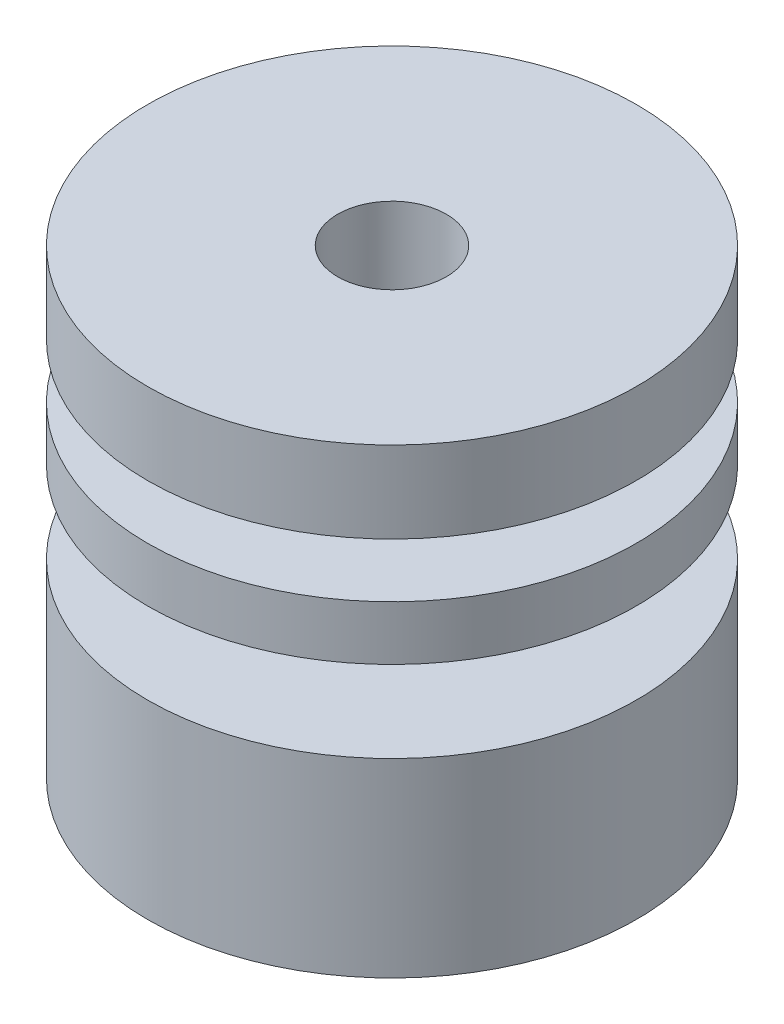
ISO-10303-21;
HEADER;
FILE_DESCRIPTION(('STEP AP214'),'2;1');
FILE_NAME('part.step','',(''),(''),'','','');
FILE_SCHEMA(('AUTOMOTIVE_DESIGN { 1 0 10303 214 1 1 1 1 }'));
ENDSEC;
DATA;
#1=APPLICATION_CONTEXT('core data for automotive mechanical design processes');
#2=APPLICATION_PROTOCOL_DEFINITION('international standard','automotive_design',2000,#1);
#3=PRODUCT_CONTEXT('',#1,'mechanical');
#4=PRODUCT('Part','Part','',(#3));
#5=PRODUCT_RELATED_PRODUCT_CATEGORY('part','',(#4));
#6=PRODUCT_DEFINITION_FORMATION('','',#4);
#7=PRODUCT_DEFINITION_CONTEXT('part definition',#1,'design');
#8=PRODUCT_DEFINITION('design','',#6,#7);
#9=PRODUCT_DEFINITION_SHAPE('','',#8);
#10=(LENGTH_UNIT() NAMED_UNIT(*) SI_UNIT(.MILLI.,.METRE.));
#11=(NAMED_UNIT(*) PLANE_ANGLE_UNIT() SI_UNIT($,.RADIAN.));
#12=(NAMED_UNIT(*) SI_UNIT($,.STERADIAN.) SOLID_ANGLE_UNIT());
#13=UNCERTAINTY_MEASURE_WITH_UNIT(LENGTH_MEASURE(1.E-05),#10,'distance_accuracy_value','');
#14=(GEOMETRIC_REPRESENTATION_CONTEXT(3) GLOBAL_UNCERTAINTY_ASSIGNED_CONTEXT((#13)) GLOBAL_UNIT_ASSIGNED_CONTEXT((#10,
#11,#12)) REPRESENTATION_CONTEXT('',''));
#15=CARTESIAN_POINT('',(0.,0.,0.));
#16=DIRECTION('',(0.,0.,1.));
#17=DIRECTION('',(1.,0.,0.));
#18=AXIS2_PLACEMENT_3D('',#15,#16,#17);
#19=CARTESIAN_POINT('',(0.,0.,0.));
#20=DIRECTION('',(0.,-1.,0.));
#21=DIRECTION('',(0.,0.,-1.));
#22=AXIS2_PLACEMENT_3D('',#19,#20,#21);
#23=CYLINDRICAL_SURFACE('',#22,4.5);
#24=CARTESIAN_POINT('',(0.,12.,0.));
#25=DIRECTION('',(0.,-1.,0.));
#26=DIRECTION('',(0.,0.,-1.));
#27=AXIS2_PLACEMENT_3D('',#24,#25,#26);
#28=CIRCLE('',#27,4.5);
#29=CARTESIAN_POINT('',(0.,12.,-4.5));
#30=VERTEX_POINT('',#29);
#31=EDGE_CURVE('E76',#30,#30,#28,.T.);
#32=ORIENTED_EDGE('',*,*,#31,.F.);
#33=EDGE_LOOP('',(#32));
#34=FACE_BOUND('',#33,.T.);
#35=CARTESIAN_POINT('',(0.,14.,0.));
#36=DIRECTION('',(0.,-1.,0.));
#37=DIRECTION('',(0.,0.,-1.));
#38=AXIS2_PLACEMENT_3D('',#35,#36,#37);
#39=CIRCLE('',#38,4.5);
#40=CARTESIAN_POINT('',(0.,14.,-4.5));
#41=VERTEX_POINT('',#40);
#42=EDGE_CURVE('E10',#41,#41,#39,.T.);
#43=ORIENTED_EDGE('',*,*,#42,.T.);
#44=EDGE_LOOP('',(#43));
#45=FACE_BOUND('',#44,.T.);
#46=ADVANCED_FACE('F36',(#34,#45),#23,.T.);
#47=CARTESIAN_POINT('',(0.,14.,0.));
#48=DIRECTION('',(0.,-1.,0.));
#49=DIRECTION('',(0.,0.,-1.));
#50=AXIS2_PLACEMENT_3D('',#47,#48,#49);
#51=PLANE('',#50);
#52=CARTESIAN_POINT('',(0.,14.,0.));
#53=DIRECTION('',(0.,-1.,0.));
#54=DIRECTION('',(0.,0.,-1.));
#55=AXIS2_PLACEMENT_3D('',#52,#53,#54);
#56=CIRCLE('',#55,9.);
#57=CARTESIAN_POINT('',(0.,14.,-9.));
#58=VERTEX_POINT('',#57);
#59=EDGE_CURVE('E42',#58,#58,#56,.T.);
#60=ORIENTED_EDGE('',*,*,#59,.T.);
#61=EDGE_LOOP('',(#60));
#62=FACE_BOUND('',#61,.T.);
#63=ORIENTED_EDGE('',*,*,#42,.F.);
#64=EDGE_LOOP('',(#63));
#65=FACE_BOUND('',#64,.T.);
#66=ADVANCED_FACE('F83',(#62,#65),#51,.T.);
#67=CARTESIAN_POINT('',(0.,0.,0.));
#68=DIRECTION('',(0.,-1.,0.));
#69=DIRECTION('',(0.,0.,-1.));
#70=AXIS2_PLACEMENT_3D('',#67,#68,#69);
#71=CYLINDRICAL_SURFACE('',#70,9.);
#72=ORIENTED_EDGE('',*,*,#59,.F.);
#73=EDGE_LOOP('',(#72));
#74=FACE_BOUND('',#73,.T.);
#75=CARTESIAN_POINT('',(0.,17.,0.));
#76=DIRECTION('',(0.,-1.,0.));
#77=DIRECTION('',(0.,0.,-1.));
#78=AXIS2_PLACEMENT_3D('',#75,#76,#77);
#79=CIRCLE('',#78,9.);
#80=CARTESIAN_POINT('',(0.,17.,-9.));
#81=VERTEX_POINT('',#80);
#82=EDGE_CURVE('E46',#81,#81,#79,.T.);
#83=ORIENTED_EDGE('',*,*,#82,.T.);
#84=EDGE_LOOP('',(#83));
#85=FACE_BOUND('',#84,.T.);
#86=ADVANCED_FACE('F87',(#74,#85),#71,.T.);
#87=CARTESIAN_POINT('',(0.,17.,0.));
#88=DIRECTION('',(0.,1.,0.));
#89=DIRECTION('',(0.,0.,1.));
#90=AXIS2_PLACEMENT_3D('',#87,#88,#89);
#91=PLANE('',#90);
#92=CARTESIAN_POINT('',(0.,17.,0.));
#93=DIRECTION('',(0.,-1.,0.));
#94=DIRECTION('',(0.,0.,-1.));
#95=AXIS2_PLACEMENT_3D('',#92,#93,#94);
#96=CIRCLE('',#95,2.);
#97=CARTESIAN_POINT('',(0.,17.,-2.));
#98=VERTEX_POINT('',#97);
#99=EDGE_CURVE('E50',#98,#98,#96,.T.);
#100=ORIENTED_EDGE('',*,*,#99,.T.);
#101=EDGE_LOOP('',(#100));
#102=FACE_BOUND('',#101,.T.);
#103=ORIENTED_EDGE('',*,*,#82,.F.);
#104=EDGE_LOOP('',(#103));
#105=FACE_BOUND('',#104,.T.);
#106=ADVANCED_FACE('F91',(#102,#105),#91,.T.);
#107=CARTESIAN_POINT('',(0.,0.,0.));
#108=DIRECTION('',(0.,-1.,0.));
#109=DIRECTION('',(0.,0.,-1.));
#110=AXIS2_PLACEMENT_3D('',#107,#108,#109);
#111=CYLINDRICAL_SURFACE('',#110,2.);
#112=CARTESIAN_POINT('',(0.,0.,0.));
#113=DIRECTION('',(0.,-1.,0.));
#114=DIRECTION('',(0.,0.,-1.));
#115=AXIS2_PLACEMENT_3D('',#112,#113,#114);
#116=CIRCLE('',#115,2.);
#117=CARTESIAN_POINT('',(0.,0.,-2.));
#118=VERTEX_POINT('',#117);
#119=EDGE_CURVE('E55',#118,#118,#116,.T.);
#120=ORIENTED_EDGE('',*,*,#119,.T.);
#121=EDGE_LOOP('',(#120));
#122=FACE_BOUND('',#121,.T.);
#123=ORIENTED_EDGE('',*,*,#99,.F.);
#124=EDGE_LOOP('',(#123));
#125=FACE_BOUND('',#124,.T.);
#126=ADVANCED_FACE('F98',(#122,#125),#111,.F.);
#127=CARTESIAN_POINT('',(0.,0.,0.));
#128=DIRECTION('',(0.,1.,0.));
#129=DIRECTION('',(0.,0.,1.));
#130=AXIS2_PLACEMENT_3D('',#127,#128,#129);
#131=PLANE('',#130);
#132=ORIENTED_EDGE('',*,*,#119,.F.);
#133=EDGE_LOOP('',(#132));
#134=FACE_BOUND('',#133,.T.);
#135=CARTESIAN_POINT('',(0.,0.,0.));
#136=DIRECTION('',(0.,-1.,0.));
#137=DIRECTION('',(0.,0.,-1.));
#138=AXIS2_PLACEMENT_3D('',#135,#136,#137);
#139=CIRCLE('',#138,9.);
#140=CARTESIAN_POINT('',(0.,0.,-9.));
#141=VERTEX_POINT('',#140);
#142=EDGE_CURVE('E58',#141,#141,#139,.T.);
#143=ORIENTED_EDGE('',*,*,#142,.T.);
#144=EDGE_LOOP('',(#143));
#145=FACE_BOUND('',#144,.T.);
#146=ADVANCED_FACE('F102',(#134,#145),#131,.F.);
#147=CARTESIAN_POINT('',(0.,0.,0.));
#148=DIRECTION('',(0.,-1.,0.));
#149=DIRECTION('',(0.,0.,-1.));
#150=AXIS2_PLACEMENT_3D('',#147,#148,#149);
#151=CYLINDRICAL_SURFACE('',#150,9.);
#152=CARTESIAN_POINT('',(0.,7.,0.));
#153=DIRECTION('',(0.,-1.,0.));
#154=DIRECTION('',(0.,0.,-1.));
#155=AXIS2_PLACEMENT_3D('',#152,#153,#154);
#156=CIRCLE('',#155,9.);
#157=CARTESIAN_POINT('',(0.,7.,-9.));
#158=VERTEX_POINT('',#157);
#159=EDGE_CURVE('E61',#158,#158,#156,.T.);
#160=ORIENTED_EDGE('',*,*,#159,.T.);
#161=EDGE_LOOP('',(#160));
#162=FACE_BOUND('',#161,.T.);
#163=ORIENTED_EDGE('',*,*,#142,.F.);
#164=EDGE_LOOP('',(#163));
#165=FACE_BOUND('',#164,.T.);
#166=ADVANCED_FACE('F106',(#162,#165),#151,.T.);
#167=CARTESIAN_POINT('',(0.,7.,0.));
#168=DIRECTION('',(0.,-1.,0.));
#169=DIRECTION('',(0.,0.,-1.));
#170=AXIS2_PLACEMENT_3D('',#167,#168,#169);
#171=PLANE('',#170);
#172=ORIENTED_EDGE('',*,*,#159,.F.);
#173=EDGE_LOOP('',(#172));
#174=FACE_BOUND('',#173,.T.);
#175=CARTESIAN_POINT('',(0.,7.,0.));
#176=DIRECTION('',(0.,-1.,0.));
#177=DIRECTION('',(0.,0.,-1.));
#178=AXIS2_PLACEMENT_3D('',#175,#176,#177);
#179=CIRCLE('',#178,4.5);
#180=CARTESIAN_POINT('',(0.,7.,-4.5));
#181=VERTEX_POINT('',#180);
#182=EDGE_CURVE('E64',#181,#181,#179,.T.);
#183=ORIENTED_EDGE('',*,*,#182,.T.);
#184=EDGE_LOOP('',(#183));
#185=FACE_BOUND('',#184,.T.);
#186=ADVANCED_FACE('F110',(#174,#185),#171,.F.);
#187=CARTESIAN_POINT('',(0.,0.,0.));
#188=DIRECTION('',(0.,-1.,0.));
#189=DIRECTION('',(0.,0.,-1.));
#190=AXIS2_PLACEMENT_3D('',#187,#188,#189);
#191=CYLINDRICAL_SURFACE('',#190,4.5);
#192=ORIENTED_EDGE('',*,*,#182,.F.);
#193=EDGE_LOOP('',(#192));
#194=FACE_BOUND('',#193,.T.);
#195=CARTESIAN_POINT('',(0.,10.,0.));
#196=DIRECTION('',(0.,-1.,0.));
#197=DIRECTION('',(0.,0.,-1.));
#198=AXIS2_PLACEMENT_3D('',#195,#196,#197);
#199=CIRCLE('',#198,4.5);
#200=CARTESIAN_POINT('',(0.,10.,-4.5));
#201=VERTEX_POINT('',#200);
#202=EDGE_CURVE('E67',#201,#201,#199,.T.);
#203=ORIENTED_EDGE('',*,*,#202,.T.);
#204=EDGE_LOOP('',(#203));
#205=FACE_BOUND('',#204,.T.);
#206=ADVANCED_FACE('F114',(#194,#205),#191,.T.);
#207=CARTESIAN_POINT('',(0.,10.,0.));
#208=DIRECTION('',(0.,-1.,0.));
#209=DIRECTION('',(0.,0.,-1.));
#210=AXIS2_PLACEMENT_3D('',#207,#208,#209);
#211=PLANE('',#210);
#212=CARTESIAN_POINT('',(0.,10.,0.));
#213=DIRECTION('',(0.,-1.,0.));
#214=DIRECTION('',(0.,0.,-1.));
#215=AXIS2_PLACEMENT_3D('',#212,#213,#214);
#216=CIRCLE('',#215,9.);
#217=CARTESIAN_POINT('',(0.,10.,-9.));
#218=VERTEX_POINT('',#217);
#219=EDGE_CURVE('E70',#218,#218,#216,.T.);
#220=ORIENTED_EDGE('',*,*,#219,.T.);
#221=EDGE_LOOP('',(#220));
#222=FACE_BOUND('',#221,.T.);
#223=ORIENTED_EDGE('',*,*,#202,.F.);
#224=EDGE_LOOP('',(#223));
#225=FACE_BOUND('',#224,.T.);
#226=ADVANCED_FACE('F118',(#222,#225),#211,.T.);
#227=CARTESIAN_POINT('',(0.,0.,0.));
#228=DIRECTION('',(0.,-1.,0.));
#229=DIRECTION('',(0.,0.,-1.));
#230=AXIS2_PLACEMENT_3D('',#227,#228,#229);
#231=CYLINDRICAL_SURFACE('',#230,9.);
#232=CARTESIAN_POINT('',(0.,12.,0.));
#233=DIRECTION('',(0.,-1.,0.));
#234=DIRECTION('',(0.,0.,-1.));
#235=AXIS2_PLACEMENT_3D('',#232,#233,#234);
#236=CIRCLE('',#235,9.);
#237=CARTESIAN_POINT('',(0.,12.,-9.));
#238=VERTEX_POINT('',#237);
#239=EDGE_CURVE('E73',#238,#238,#236,.T.);
#240=ORIENTED_EDGE('',*,*,#239,.T.);
#241=EDGE_LOOP('',(#240));
#242=FACE_BOUND('',#241,.T.);
#243=ORIENTED_EDGE('',*,*,#219,.F.);
#244=EDGE_LOOP('',(#243));
#245=FACE_BOUND('',#244,.T.);
#246=ADVANCED_FACE('F122',(#242,#245),#231,.T.);
#247=CARTESIAN_POINT('',(0.,12.,0.));
#248=DIRECTION('',(0.,-1.,0.));
#249=DIRECTION('',(0.,0.,-1.));
#250=AXIS2_PLACEMENT_3D('',#247,#248,#249);
#251=PLANE('',#250);
#252=ORIENTED_EDGE('',*,*,#239,.F.);
#253=EDGE_LOOP('',(#252));
#254=FACE_BOUND('',#253,.T.);
#255=ORIENTED_EDGE('',*,*,#31,.T.);
#256=EDGE_LOOP('',(#255));
#257=FACE_BOUND('',#256,.T.);
#258=ADVANCED_FACE('F80',(#254,#257),#251,.F.);
#259=CLOSED_SHELL('',(#46,#66,#86,#106,#126,#146,#166,#186,#206,#226,#246,#258));
#260=MANIFOLD_SOLID_BREP('B2',#259);
#261=ADVANCED_BREP_SHAPE_REPRESENTATION('',(#18,#260),#14);
#262=SHAPE_DEFINITION_REPRESENTATION(#9,#261);
ENDSEC;
END-ISO-10303-21;
